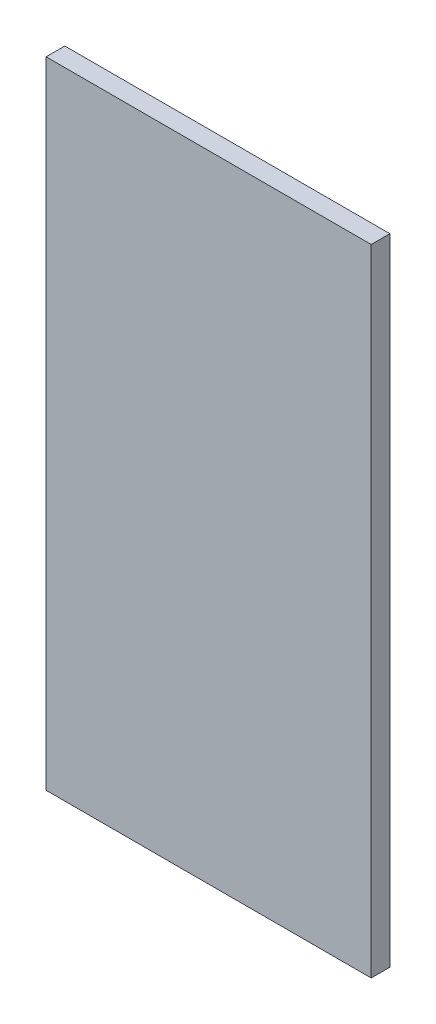
ISO-10303-21;
HEADER;
FILE_DESCRIPTION(('STEP AP214'),'2;1');
FILE_NAME('part.step','',(''),(''),'','','');
FILE_SCHEMA(('AUTOMOTIVE_DESIGN { 1 0 10303 214 1 1 1 1 }'));
ENDSEC;
DATA;
#1=APPLICATION_CONTEXT('core data for automotive mechanical design processes');
#2=APPLICATION_PROTOCOL_DEFINITION('international standard','automotive_design',2000,#1);
#3=PRODUCT_CONTEXT('',#1,'mechanical');
#4=PRODUCT('Part','Part','',(#3));
#5=PRODUCT_RELATED_PRODUCT_CATEGORY('part','',(#4));
#6=PRODUCT_DEFINITION_FORMATION('','',#4);
#7=PRODUCT_DEFINITION_CONTEXT('part definition',#1,'design');
#8=PRODUCT_DEFINITION('design','',#6,#7);
#9=PRODUCT_DEFINITION_SHAPE('','',#8);
#10=(LENGTH_UNIT() NAMED_UNIT(*) SI_UNIT(.MILLI.,.METRE.));
#11=(NAMED_UNIT(*) PLANE_ANGLE_UNIT() SI_UNIT($,.RADIAN.));
#12=(NAMED_UNIT(*) SI_UNIT($,.STERADIAN.) SOLID_ANGLE_UNIT());
#13=UNCERTAINTY_MEASURE_WITH_UNIT(LENGTH_MEASURE(1.E-05),#10,'distance_accuracy_value','');
#14=(GEOMETRIC_REPRESENTATION_CONTEXT(3) GLOBAL_UNCERTAINTY_ASSIGNED_CONTEXT((#13)) GLOBAL_UNIT_ASSIGNED_CONTEXT((#10,
#11,#12)) REPRESENTATION_CONTEXT('',''));
#15=CARTESIAN_POINT('',(0.,0.,0.));
#16=DIRECTION('',(0.,0.,1.));
#17=DIRECTION('',(1.,0.,0.));
#18=AXIS2_PLACEMENT_3D('',#15,#16,#17);
#19=CARTESIAN_POINT('',(-15.,-35.,0.));
#20=DIRECTION('',(0.,0.,1.));
#21=DIRECTION('',(1.,0.,0.));
#22=AXIS2_PLACEMENT_3D('',#19,#20,#21);
#23=PLANE('',#22);
#24=DIRECTION('',(0.,1.,0.));
#25=VECTOR('',#24,1.);
#26=CARTESIAN_POINT('',(-100.,-120.,0.));
#27=LINE('',#26,#25);
#28=CARTESIAN_POINT('',(-100.,-120.,0.));
#29=VERTEX_POINT('',#28);
#30=CARTESIAN_POINT('',(-100.,50.,0.));
#31=VERTEX_POINT('',#30);
#32=EDGE_CURVE('E18',#29,#31,#27,.T.);
#33=ORIENTED_EDGE('',*,*,#32,.T.);
#34=DIRECTION('',(1.,0.,0.));
#35=VECTOR('',#34,1.);
#36=CARTESIAN_POINT('',(-100.,50.,0.));
#37=LINE('',#36,#35);
#38=CARTESIAN_POINT('',(-13.,50.,0.));
#39=VERTEX_POINT('',#38);
#40=EDGE_CURVE('E67',#31,#39,#37,.T.);
#41=ORIENTED_EDGE('',*,*,#40,.T.);
#42=DIRECTION('',(0.,-1.,0.));
#43=VECTOR('',#42,1.);
#44=CARTESIAN_POINT('',(-13.,-77.5,0.));
#45=LINE('',#44,#43);
#46=CARTESIAN_POINT('',(-13.,-120.,0.));
#47=VERTEX_POINT('',#46);
#48=EDGE_CURVE('E10',#39,#47,#45,.T.);
#49=ORIENTED_EDGE('',*,*,#48,.T.);
#50=DIRECTION('',(-1.,0.,0.));
#51=VECTOR('',#50,1.);
#52=CARTESIAN_POINT('',(70.,-120.,0.));
#53=LINE('',#52,#51);
#54=EDGE_CURVE('E79',#47,#29,#53,.T.);
#55=ORIENTED_EDGE('',*,*,#54,.T.);
#56=EDGE_LOOP('',(#33,#41,#49,#55));
#57=FACE_BOUND('',#56,.T.);
#58=ADVANCED_FACE('F15',(#57),#23,.F.);
#59=CARTESIAN_POINT('',(-13.,-120.,0.));
#60=DIRECTION('',(1.,0.,0.));
#61=DIRECTION('',(0.,1.,0.));
#62=AXIS2_PLACEMENT_3D('',#59,#60,#61);
#63=PLANE('',#62);
#64=ORIENTED_EDGE('',*,*,#48,.F.);
#65=DIRECTION('',(0.,0.,1.));
#66=VECTOR('',#65,1.);
#67=CARTESIAN_POINT('',(-13.,50.,0.));
#68=LINE('',#67,#66);
#69=CARTESIAN_POINT('',(-13.,50.,5.));
#70=VERTEX_POINT('',#69);
#71=EDGE_CURVE('E25',#39,#70,#68,.T.);
#72=ORIENTED_EDGE('',*,*,#71,.T.);
#73=DIRECTION('',(0.,1.,0.));
#74=VECTOR('',#73,1.);
#75=CARTESIAN_POINT('',(-13.,-77.5,5.));
#76=LINE('',#75,#74);
#77=CARTESIAN_POINT('',(-13.,-120.,5.));
#78=VERTEX_POINT('',#77);
#79=EDGE_CURVE('E62',#78,#70,#76,.T.);
#80=ORIENTED_EDGE('',*,*,#79,.F.);
#81=DIRECTION('',(0.,0.,1.));
#82=VECTOR('',#81,1.);
#83=CARTESIAN_POINT('',(-13.,-120.,0.));
#84=LINE('',#83,#82);
#85=EDGE_CURVE('E97',#47,#78,#84,.T.);
#86=ORIENTED_EDGE('',*,*,#85,.F.);
#87=EDGE_LOOP('',(#64,#72,#80,#86));
#88=FACE_BOUND('',#87,.T.);
#89=ADVANCED_FACE('F60',(#88),#63,.T.);
#90=CARTESIAN_POINT('',(70.,50.,0.));
#91=DIRECTION('',(0.,1.,0.));
#92=DIRECTION('',(1.,0.,0.));
#93=AXIS2_PLACEMENT_3D('',#90,#91,#92);
#94=PLANE('',#93);
#95=ORIENTED_EDGE('',*,*,#40,.F.);
#96=DIRECTION('',(0.,0.,1.));
#97=VECTOR('',#96,1.);
#98=CARTESIAN_POINT('',(-100.,50.,0.));
#99=LINE('',#98,#97);
#100=CARTESIAN_POINT('',(-100.,50.,5.));
#101=VERTEX_POINT('',#100);
#102=EDGE_CURVE('E74',#31,#101,#99,.T.);
#103=ORIENTED_EDGE('',*,*,#102,.T.);
#104=DIRECTION('',(-1.,0.,0.));
#105=VECTOR('',#104,1.);
#106=CARTESIAN_POINT('',(-100.,50.,5.));
#107=LINE('',#106,#105);
#108=EDGE_CURVE('E71',#70,#101,#107,.T.);
#109=ORIENTED_EDGE('',*,*,#108,.F.);
#110=ORIENTED_EDGE('',*,*,#71,.F.);
#111=EDGE_LOOP('',(#95,#103,#109,#110));
#112=FACE_BOUND('',#111,.T.);
#113=ADVANCED_FACE('F72',(#112),#94,.T.);
#114=CARTESIAN_POINT('',(-100.,-120.,0.));
#115=DIRECTION('',(0.,-1.,0.));
#116=DIRECTION('',(0.,0.,-1.));
#117=AXIS2_PLACEMENT_3D('',#114,#115,#116);
#118=PLANE('',#117);
#119=ORIENTED_EDGE('',*,*,#54,.F.);
#120=ORIENTED_EDGE('',*,*,#85,.T.);
#121=DIRECTION('',(1.,0.,0.));
#122=VECTOR('',#121,1.);
#123=CARTESIAN_POINT('',(70.,-120.,5.));
#124=LINE('',#123,#122);
#125=CARTESIAN_POINT('',(-100.,-120.,5.));
#126=VERTEX_POINT('',#125);
#127=EDGE_CURVE('E82',#126,#78,#124,.T.);
#128=ORIENTED_EDGE('',*,*,#127,.F.);
#129=DIRECTION('',(0.,0.,1.));
#130=VECTOR('',#129,1.);
#131=CARTESIAN_POINT('',(-100.,-120.,0.));
#132=LINE('',#131,#130);
#133=EDGE_CURVE('E88',#29,#126,#132,.T.);
#134=ORIENTED_EDGE('',*,*,#133,.F.);
#135=EDGE_LOOP('',(#119,#120,#128,#134));
#136=FACE_BOUND('',#135,.T.);
#137=ADVANCED_FACE('F131',(#136),#118,.T.);
#138=CARTESIAN_POINT('',(-15.,-35.,5.));
#139=DIRECTION('',(0.,0.,1.));
#140=DIRECTION('',(1.,0.,0.));
#141=AXIS2_PLACEMENT_3D('',#138,#139,#140);
#142=PLANE('',#141);
#143=DIRECTION('',(0.,-1.,0.));
#144=VECTOR('',#143,1.);
#145=CARTESIAN_POINT('',(-100.,-120.,5.));
#146=LINE('',#145,#144);
#147=EDGE_CURVE('E91',#101,#126,#146,.T.);
#148=ORIENTED_EDGE('',*,*,#147,.T.);
#149=ORIENTED_EDGE('',*,*,#127,.T.);
#150=ORIENTED_EDGE('',*,*,#79,.T.);
#151=ORIENTED_EDGE('',*,*,#108,.T.);
#152=EDGE_LOOP('',(#148,#149,#150,#151));
#153=FACE_BOUND('',#152,.T.);
#154=ADVANCED_FACE('F81',(#153),#142,.T.);
#155=CARTESIAN_POINT('',(-100.,50.,0.));
#156=DIRECTION('',(-1.,0.,0.));
#157=DIRECTION('',(0.,0.,1.));
#158=AXIS2_PLACEMENT_3D('',#155,#156,#157);
#159=PLANE('',#158);
#160=ORIENTED_EDGE('',*,*,#147,.F.);
#161=ORIENTED_EDGE('',*,*,#102,.F.);
#162=ORIENTED_EDGE('',*,*,#32,.F.);
#163=ORIENTED_EDGE('',*,*,#133,.T.);
#164=EDGE_LOOP('',(#160,#161,#162,#163));
#165=FACE_BOUND('',#164,.T.);
#166=ADVANCED_FACE('F115',(#165),#159,.T.);
#167=CLOSED_SHELL('',(#58,#89,#113,#137,#154,#166));
#168=MANIFOLD_SOLID_BREP('B1',#167);
#169=ADVANCED_BREP_SHAPE_REPRESENTATION('',(#18,#168),#14);
#170=SHAPE_DEFINITION_REPRESENTATION(#9,#169);
ENDSEC;
END-ISO-10303-21;
